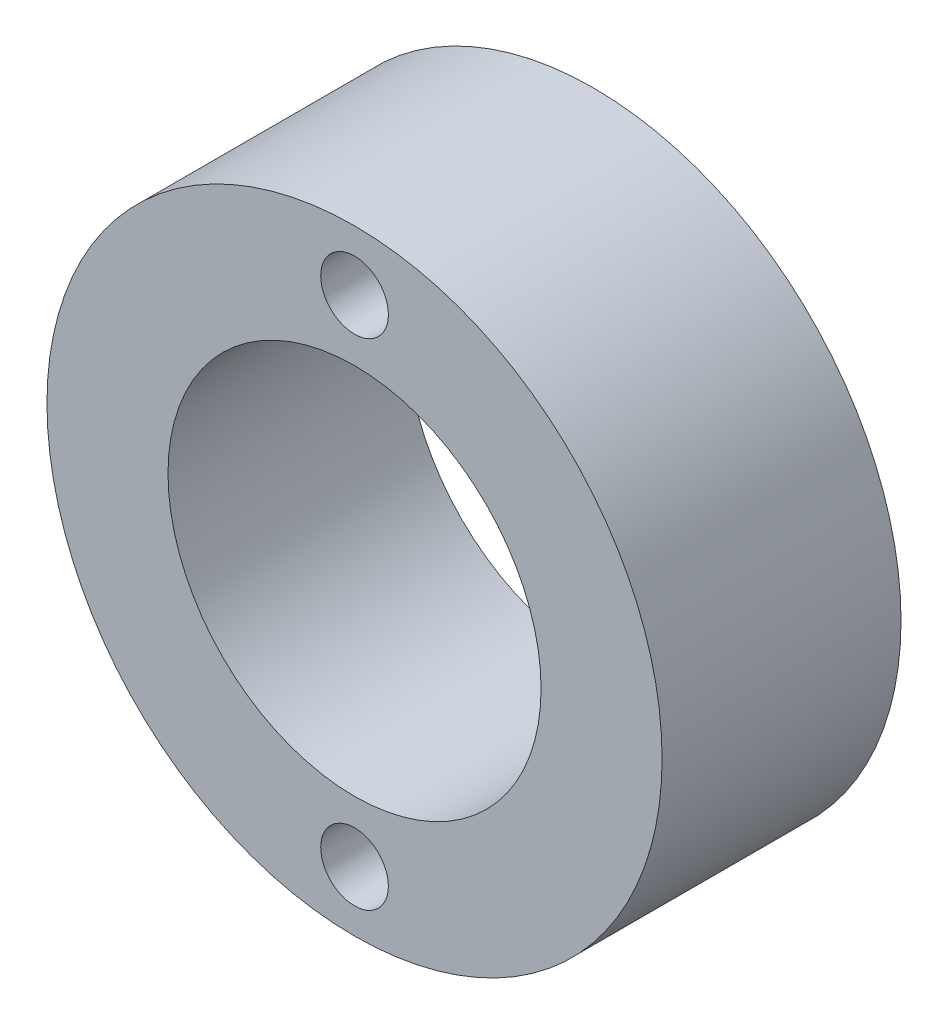
ISO-10303-21;
HEADER;
FILE_DESCRIPTION(('STEP AP214'),'2;1');
FILE_NAME('part.step','',(''),(''),'','','');
FILE_SCHEMA(('AUTOMOTIVE_DESIGN { 1 0 10303 214 1 1 1 1 }'));
ENDSEC;
DATA;
#1=APPLICATION_CONTEXT('core data for automotive mechanical design processes');
#2=APPLICATION_PROTOCOL_DEFINITION('international standard','automotive_design',2000,#1);
#3=PRODUCT_CONTEXT('',#1,'mechanical');
#4=PRODUCT('Part','Part','',(#3));
#5=PRODUCT_RELATED_PRODUCT_CATEGORY('part','',(#4));
#6=PRODUCT_DEFINITION_FORMATION('','',#4);
#7=PRODUCT_DEFINITION_CONTEXT('part definition',#1,'design');
#8=PRODUCT_DEFINITION('design','',#6,#7);
#9=PRODUCT_DEFINITION_SHAPE('','',#8);
#10=(LENGTH_UNIT() NAMED_UNIT(*) SI_UNIT(.MILLI.,.METRE.));
#11=(NAMED_UNIT(*) PLANE_ANGLE_UNIT() SI_UNIT($,.RADIAN.));
#12=(NAMED_UNIT(*) SI_UNIT($,.STERADIAN.) SOLID_ANGLE_UNIT());
#13=UNCERTAINTY_MEASURE_WITH_UNIT(LENGTH_MEASURE(1.E-05),#10,'distance_accuracy_value','');
#14=(GEOMETRIC_REPRESENTATION_CONTEXT(3) GLOBAL_UNCERTAINTY_ASSIGNED_CONTEXT((#13)) GLOBAL_UNIT_ASSIGNED_CONTEXT((#10,
#11,#12)) REPRESENTATION_CONTEXT('',''));
#15=CARTESIAN_POINT('',(0.,0.,0.));
#16=DIRECTION('',(0.,0.,1.));
#17=DIRECTION('',(1.,0.,0.));
#18=AXIS2_PLACEMENT_3D('',#15,#16,#17);
#19=CARTESIAN_POINT('',(0.,15.,7.07697560572969));
#20=DIRECTION('',(0.,0.,-1.));
#21=DIRECTION('',(-1.,0.,0.));
#22=AXIS2_PLACEMENT_3D('',#19,#20,#21);
#23=CYLINDRICAL_SURFACE('',#22,2.05);
#24=CARTESIAN_POINT('',(0.,15.,15.7567));
#25=DIRECTION('',(0.,0.,1.));
#26=DIRECTION('',(1.,0.,0.));
#27=AXIS2_PLACEMENT_3D('',#24,#25,#26);
#28=CIRCLE('',#27,2.05);
#29=CARTESIAN_POINT('',(2.05,15.,15.7567));
#30=VERTEX_POINT('',#29);
#31=EDGE_CURVE('E49',#30,#30,#28,.T.);
#32=ORIENTED_EDGE('',*,*,#31,.T.);
#33=EDGE_LOOP('',(#32));
#34=FACE_BOUND('',#33,.T.);
#35=CARTESIAN_POINT('',(0.,15.,1.2787));
#36=DIRECTION('',(0.,0.,-1.));
#37=DIRECTION('',(-1.,0.,0.));
#38=AXIS2_PLACEMENT_3D('',#35,#36,#37);
#39=CIRCLE('',#38,2.05);
#40=CARTESIAN_POINT('',(-2.05,15.,1.2787));
#41=VERTEX_POINT('',#40);
#42=EDGE_CURVE('E60',#41,#41,#39,.F.);
#43=ORIENTED_EDGE('',*,*,#42,.F.);
#44=EDGE_LOOP('',(#43));
#45=FACE_BOUND('',#44,.T.);
#46=ADVANCED_FACE('F37',(#34,#45),#23,.F.);
#47=CARTESIAN_POINT('',(0.,-15.,7.07697560572969));
#48=DIRECTION('',(0.,0.,-1.));
#49=DIRECTION('',(-1.,0.,0.));
#50=AXIS2_PLACEMENT_3D('',#47,#48,#49);
#51=CYLINDRICAL_SURFACE('',#50,2.05);
#52=CARTESIAN_POINT('',(0.,-15.,15.7567));
#53=DIRECTION('',(0.,0.,1.));
#54=DIRECTION('',(1.,0.,0.));
#55=AXIS2_PLACEMENT_3D('',#52,#53,#54);
#56=CIRCLE('',#55,2.05);
#57=CARTESIAN_POINT('',(2.05,-15.,15.7567));
#58=VERTEX_POINT('',#57);
#59=EDGE_CURVE('E54',#58,#58,#56,.T.);
#60=ORIENTED_EDGE('',*,*,#59,.T.);
#61=EDGE_LOOP('',(#60));
#62=FACE_BOUND('',#61,.T.);
#63=CARTESIAN_POINT('',(0.,-15.,1.2787));
#64=DIRECTION('',(0.,0.,-1.));
#65=DIRECTION('',(-1.,0.,0.));
#66=AXIS2_PLACEMENT_3D('',#63,#64,#65);
#67=CIRCLE('',#66,2.05);
#68=CARTESIAN_POINT('',(-2.05,-15.,1.2787));
#69=VERTEX_POINT('',#68);
#70=EDGE_CURVE('E64',#69,#69,#67,.F.);
#71=ORIENTED_EDGE('',*,*,#70,.F.);
#72=EDGE_LOOP('',(#71));
#73=FACE_BOUND('',#72,.T.);
#74=ADVANCED_FACE('F95',(#62,#73),#51,.F.);
#75=CARTESIAN_POINT('',(0.,0.,-5.9603));
#76=DIRECTION('',(0.,0.,1.));
#77=DIRECTION('',(1.,0.,0.));
#78=AXIS2_PLACEMENT_3D('',#75,#76,#77);
#79=CYLINDRICAL_SURFACE('',#78,11.303);
#80=CARTESIAN_POINT('',(0.,0.,15.7567));
#81=DIRECTION('',(0.,0.,1.));
#82=DIRECTION('',(1.,0.,0.));
#83=AXIS2_PLACEMENT_3D('',#80,#81,#82);
#84=CIRCLE('',#83,11.303);
#85=CARTESIAN_POINT('',(11.303,0.,15.7567));
#86=VERTEX_POINT('',#85);
#87=EDGE_CURVE('E44',#86,#86,#84,.T.);
#88=ORIENTED_EDGE('',*,*,#87,.T.);
#89=EDGE_LOOP('',(#88));
#90=FACE_BOUND('',#89,.T.);
#91=CARTESIAN_POINT('',(0.,0.,1.2787));
#92=DIRECTION('',(0.,0.,-1.));
#93=DIRECTION('',(-1.,0.,0.));
#94=AXIS2_PLACEMENT_3D('',#91,#92,#93);
#95=CIRCLE('',#94,11.303);
#96=CARTESIAN_POINT('',(-11.303,0.,1.2787));
#97=VERTEX_POINT('',#96);
#98=EDGE_CURVE('E68',#97,#97,#95,.F.);
#99=ORIENTED_EDGE('',*,*,#98,.F.);
#100=EDGE_LOOP('',(#99));
#101=FACE_BOUND('',#100,.T.);
#102=ADVANCED_FACE('F90',(#90,#101),#79,.F.);
#103=CARTESIAN_POINT('',(0.,0.,15.7567));
#104=DIRECTION('',(0.,0.,1.));
#105=DIRECTION('',(1.,0.,0.));
#106=AXIS2_PLACEMENT_3D('',#103,#104,#105);
#107=PLANE('',#106);
#108=ORIENTED_EDGE('',*,*,#31,.F.);
#109=EDGE_LOOP('',(#108));
#110=FACE_BOUND('',#109,.T.);
#111=CARTESIAN_POINT('',(0.,0.,15.7567));
#112=DIRECTION('',(0.,0.,1.));
#113=DIRECTION('',(1.,0.,0.));
#114=AXIS2_PLACEMENT_3D('',#111,#112,#113);
#115=CIRCLE('',#114,18.6375);
#116=CARTESIAN_POINT('',(18.6375,0.,15.7567));
#117=VERTEX_POINT('',#116);
#118=EDGE_CURVE('E10',#117,#117,#115,.T.);
#119=ORIENTED_EDGE('',*,*,#118,.T.);
#120=EDGE_LOOP('',(#119));
#121=FACE_BOUND('',#120,.T.);
#122=ORIENTED_EDGE('',*,*,#87,.F.);
#123=EDGE_LOOP('',(#122));
#124=FACE_BOUND('',#123,.T.);
#125=ORIENTED_EDGE('',*,*,#59,.F.);
#126=EDGE_LOOP('',(#125));
#127=FACE_BOUND('',#126,.T.);
#128=ADVANCED_FACE('F82',(#110,#121,#124,#127),#107,.T.);
#129=CARTESIAN_POINT('',(0.,0.,15.7567));
#130=DIRECTION('',(0.,0.,-1.));
#131=DIRECTION('',(-1.,0.,0.));
#132=AXIS2_PLACEMENT_3D('',#129,#130,#131);
#133=CYLINDRICAL_SURFACE('',#132,18.6375);
#134=ORIENTED_EDGE('',*,*,#118,.F.);
#135=EDGE_LOOP('',(#134));
#136=FACE_BOUND('',#135,.T.);
#137=CARTESIAN_POINT('',(0.,0.,1.2787));
#138=DIRECTION('',(0.,0.,-1.));
#139=DIRECTION('',(-1.,0.,0.));
#140=AXIS2_PLACEMENT_3D('',#137,#138,#139);
#141=CIRCLE('',#140,18.6375);
#142=CARTESIAN_POINT('',(-18.6375,0.,1.2787));
#143=VERTEX_POINT('',#142);
#144=EDGE_CURVE('E72',#143,#143,#141,.T.);
#145=ORIENTED_EDGE('',*,*,#144,.F.);
#146=EDGE_LOOP('',(#145));
#147=FACE_BOUND('',#146,.T.);
#148=ADVANCED_FACE('F80',(#136,#147),#133,.T.);
#149=CARTESIAN_POINT('',(0.,-21.971,1.2787));
#150=DIRECTION('',(0.,0.,-1.));
#151=DIRECTION('',(-1.,0.,0.));
#152=AXIS2_PLACEMENT_3D('',#149,#150,#151);
#153=PLANE('',#152);
#154=ORIENTED_EDGE('',*,*,#144,.T.);
#155=EDGE_LOOP('',(#154));
#156=FACE_BOUND('',#155,.T.);
#157=ORIENTED_EDGE('',*,*,#98,.T.);
#158=EDGE_LOOP('',(#157));
#159=FACE_BOUND('',#158,.T.);
#160=ORIENTED_EDGE('',*,*,#70,.T.);
#161=EDGE_LOOP('',(#160));
#162=FACE_BOUND('',#161,.T.);
#163=ORIENTED_EDGE('',*,*,#42,.T.);
#164=EDGE_LOOP('',(#163));
#165=FACE_BOUND('',#164,.T.);
#166=ADVANCED_FACE('F77',(#156,#159,#162,#165),#153,.T.);
#167=CLOSED_SHELL('',(#46,#74,#102,#128,#148,#166));
#168=MANIFOLD_SOLID_BREP('B2',#167);
#169=ADVANCED_BREP_SHAPE_REPRESENTATION('',(#18,#168),#14);
#170=SHAPE_DEFINITION_REPRESENTATION(#9,#169);
ENDSEC;
END-ISO-10303-21;
